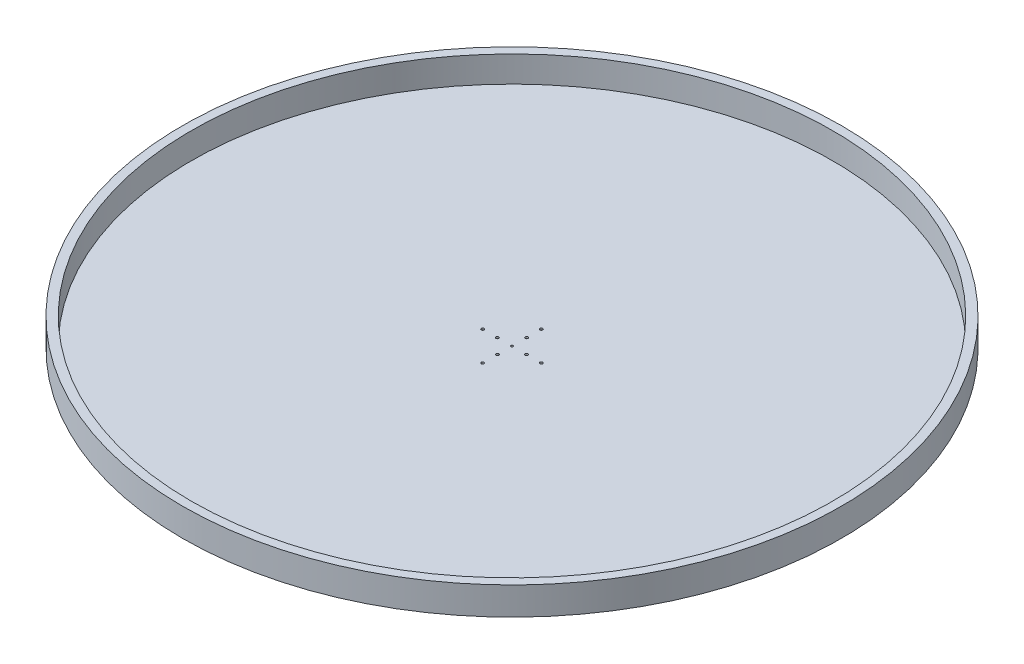
ISO-10303-21;
HEADER;
FILE_DESCRIPTION(('STEP AP214'),'2;1');
FILE_NAME('part.step','',(''),(''),'','','');
FILE_SCHEMA(('AUTOMOTIVE_DESIGN { 1 0 10303 214 1 1 1 1 }'));
ENDSEC;
DATA;
#1=APPLICATION_CONTEXT('core data for automotive mechanical design processes');
#2=APPLICATION_PROTOCOL_DEFINITION('international standard','automotive_design',2000,#1);
#3=PRODUCT_CONTEXT('',#1,'mechanical');
#4=PRODUCT('Part','Part','',(#3));
#5=PRODUCT_RELATED_PRODUCT_CATEGORY('part','',(#4));
#6=PRODUCT_DEFINITION_FORMATION('','',#4);
#7=PRODUCT_DEFINITION_CONTEXT('part definition',#1,'design');
#8=PRODUCT_DEFINITION('design','',#6,#7);
#9=PRODUCT_DEFINITION_SHAPE('','',#8);
#10=(LENGTH_UNIT() NAMED_UNIT(*) SI_UNIT(.MILLI.,.METRE.));
#11=(NAMED_UNIT(*) PLANE_ANGLE_UNIT() SI_UNIT($,.RADIAN.));
#12=(NAMED_UNIT(*) SI_UNIT($,.STERADIAN.) SOLID_ANGLE_UNIT());
#13=UNCERTAINTY_MEASURE_WITH_UNIT(LENGTH_MEASURE(1.E-05),#10,'distance_accuracy_value','');
#14=(GEOMETRIC_REPRESENTATION_CONTEXT(3) GLOBAL_UNCERTAINTY_ASSIGNED_CONTEXT((#13)) GLOBAL_UNIT_ASSIGNED_CONTEXT((#10,
#11,#12)) REPRESENTATION_CONTEXT('',''));
#15=CARTESIAN_POINT('',(0.,0.,0.));
#16=DIRECTION('',(0.,0.,1.));
#17=DIRECTION('',(1.,0.,0.));
#18=AXIS2_PLACEMENT_3D('',#15,#16,#17);
#19=CARTESIAN_POINT('',(0.,40.,0.));
#20=DIRECTION('',(0.,-1.,0.));
#21=DIRECTION('',(0.,0.,-1.));
#22=AXIS2_PLACEMENT_3D('',#19,#20,#21);
#23=CYLINDRICAL_SURFACE('',#22,472.5);
#24=CARTESIAN_POINT('',(0.,40.,0.));
#25=DIRECTION('',(0.,1.,0.));
#26=DIRECTION('',(0.,0.,1.));
#27=AXIS2_PLACEMENT_3D('',#24,#25,#26);
#28=CIRCLE('',#27,472.5);
#29=CARTESIAN_POINT('',(0.,40.,472.5));
#30=VERTEX_POINT('',#29);
#31=EDGE_CURVE('E10',#30,#30,#28,.T.);
#32=ORIENTED_EDGE('',*,*,#31,.F.);
#33=EDGE_LOOP('',(#32));
#34=FACE_BOUND('',#33,.T.);
#35=CARTESIAN_POINT('',(0.,0.,0.));
#36=DIRECTION('',(0.,1.,0.));
#37=DIRECTION('',(0.,0.,1.));
#38=AXIS2_PLACEMENT_3D('',#35,#36,#37);
#39=CIRCLE('',#38,472.5);
#40=CARTESIAN_POINT('',(0.,0.,472.5));
#41=VERTEX_POINT('',#40);
#42=EDGE_CURVE('E35',#41,#41,#39,.T.);
#43=ORIENTED_EDGE('',*,*,#42,.T.);
#44=EDGE_LOOP('',(#43));
#45=FACE_BOUND('',#44,.T.);
#46=ADVANCED_FACE('F32',(#34,#45),#23,.T.);
#47=CARTESIAN_POINT('',(0.,40.,0.));
#48=DIRECTION('',(0.,1.,0.));
#49=DIRECTION('',(0.,0.,1.));
#50=AXIS2_PLACEMENT_3D('',#47,#48,#49);
#51=PLANE('',#50);
#52=CARTESIAN_POINT('',(0.,40.,0.));
#53=DIRECTION('',(0.,1.,0.));
#54=DIRECTION('',(0.,0.,1.));
#55=AXIS2_PLACEMENT_3D('',#52,#53,#54);
#56=CIRCLE('',#55,460.);
#57=CARTESIAN_POINT('',(0.,40.,460.));
#58=VERTEX_POINT('',#57);
#59=EDGE_CURVE('E48',#58,#58,#56,.T.);
#60=ORIENTED_EDGE('',*,*,#59,.F.);
#61=EDGE_LOOP('',(#60));
#62=FACE_BOUND('',#61,.T.);
#63=ORIENTED_EDGE('',*,*,#31,.T.);
#64=EDGE_LOOP('',(#63));
#65=FACE_BOUND('',#64,.T.);
#66=ADVANCED_FACE('F165',(#62,#65),#51,.T.);
#67=CARTESIAN_POINT('',(0.,0.,0.));
#68=DIRECTION('',(0.,1.,0.));
#69=DIRECTION('',(0.,0.,1.));
#70=AXIS2_PLACEMENT_3D('',#67,#68,#69);
#71=PLANE('',#70);
#72=CARTESIAN_POINT('',(-20.9999999999994,0.,5.78204151224782E-13));
#73=DIRECTION('',(0.,1.,0.));
#74=DIRECTION('',(0.,0.,1.));
#75=AXIS2_PLACEMENT_3D('',#72,#73,#74);
#76=CIRCLE('',#75,2.02000000000096);
#77=CARTESIAN_POINT('',(-20.9999999999994,0.,2.02000000000154));
#78=VERTEX_POINT('',#77);
#79=EDGE_CURVE('E114',#78,#78,#76,.T.);
#80=ORIENTED_EDGE('',*,*,#79,.T.);
#81=EDGE_LOOP('',(#80));
#82=FACE_BOUND('',#81,.T.);
#83=CARTESIAN_POINT('',(1.16975646921169E-12,0.,21.));
#84=DIRECTION('',(0.,1.,0.));
#85=DIRECTION('',(0.,0.,1.));
#86=AXIS2_PLACEMENT_3D('',#83,#84,#85);
#87=CIRCLE('',#86,2.02000000000128);
#88=CARTESIAN_POINT('',(1.16975646921169E-12,0.,23.0200000000013));
#89=VERTEX_POINT('',#88);
#90=EDGE_CURVE('E106',#89,#89,#87,.T.);
#91=ORIENTED_EDGE('',*,*,#90,.T.);
#92=EDGE_LOOP('',(#91));
#93=FACE_BOUND('',#92,.T.);
#94=CARTESIAN_POINT('',(21.,0.,0.));
#95=DIRECTION('',(0.,1.,0.));
#96=DIRECTION('',(0.,0.,1.));
#97=AXIS2_PLACEMENT_3D('',#94,#95,#96);
#98=CIRCLE('',#97,2.02);
#99=CARTESIAN_POINT('',(21.,0.,2.02000000000009));
#100=VERTEX_POINT('',#99);
#101=EDGE_CURVE('E98',#100,#100,#98,.T.);
#102=ORIENTED_EDGE('',*,*,#101,.T.);
#103=EDGE_LOOP('',(#102));
#104=FACE_BOUND('',#103,.T.);
#105=CARTESIAN_POINT('',(-41.9999999999988,0.,1.19371179607697E-12));
#106=DIRECTION('',(0.,1.,0.));
#107=DIRECTION('',(0.,0.,1.));
#108=AXIS2_PLACEMENT_3D('',#105,#106,#107);
#109=CIRCLE('',#108,2.02000000000191);
#110=CARTESIAN_POINT('',(-41.9999999999988,0.,2.0200000000031));
#111=VERTEX_POINT('',#110);
#112=EDGE_CURVE('E90',#111,#111,#109,.T.);
#113=ORIENTED_EDGE('',*,*,#112,.T.);
#114=EDGE_LOOP('',(#113));
#115=FACE_BOUND('',#114,.T.);
#116=CARTESIAN_POINT('',(2.3771365590411E-12,0.,42.));
#117=DIRECTION('',(0.,1.,0.));
#118=DIRECTION('',(0.,0.,1.));
#119=AXIS2_PLACEMENT_3D('',#116,#117,#118);
#120=CIRCLE('',#119,2.02000000000255);
#121=CARTESIAN_POINT('',(2.3771365590411E-12,0.,44.0200000000026));
#122=VERTEX_POINT('',#121);
#123=EDGE_CURVE('E83',#122,#122,#120,.T.);
#124=ORIENTED_EDGE('',*,*,#123,.T.);
#125=EDGE_LOOP('',(#124));
#126=FACE_BOUND('',#125,.T.);
#127=CARTESIAN_POINT('',(42.0000000000012,0.,-1.18856827952055E-12));
#128=DIRECTION('',(0.,1.,0.));
#129=DIRECTION('',(0.,0.,1.));
#130=AXIS2_PLACEMENT_3D('',#127,#128,#129);
#131=CIRCLE('',#130,2.02000000000093);
#132=CARTESIAN_POINT('',(42.0000000000012,0.,2.01999999999974));
#133=VERTEX_POINT('',#132);
#134=EDGE_CURVE('E76',#133,#133,#131,.T.);
#135=ORIENTED_EDGE('',*,*,#134,.T.);
#136=EDGE_LOOP('',(#135));
#137=FACE_BOUND('',#136,.T.);
#138=CARTESIAN_POINT('',(0.,0.,-21.));
#139=DIRECTION('',(0.,1.,0.));
#140=DIRECTION('',(0.,0.,1.));
#141=AXIS2_PLACEMENT_3D('',#138,#139,#140);
#142=CIRCLE('',#141,2.02);
#143=CARTESIAN_POINT('',(0.,0.,-18.98));
#144=VERTEX_POINT('',#143);
#145=EDGE_CURVE('E68',#144,#144,#142,.T.);
#146=ORIENTED_EDGE('',*,*,#145,.T.);
#147=EDGE_LOOP('',(#146));
#148=FACE_BOUND('',#147,.T.);
#149=CARTESIAN_POINT('',(0.,0.,-42.));
#150=DIRECTION('',(0.,1.,0.));
#151=DIRECTION('',(0.,0.,1.));
#152=AXIS2_PLACEMENT_3D('',#149,#150,#151);
#153=CIRCLE('',#152,2.02);
#154=CARTESIAN_POINT('',(0.,0.,-39.98));
#155=VERTEX_POINT('',#154);
#156=EDGE_CURVE('E60',#155,#155,#153,.T.);
#157=ORIENTED_EDGE('',*,*,#156,.T.);
#158=EDGE_LOOP('',(#157));
#159=FACE_BOUND('',#158,.T.);
#160=CARTESIAN_POINT('',(0.,0.,0.));
#161=DIRECTION('',(0.,1.,0.));
#162=DIRECTION('',(0.,0.,1.));
#163=AXIS2_PLACEMENT_3D('',#160,#161,#162);
#164=CIRCLE('',#163,1.5);
#165=CARTESIAN_POINT('',(0.,0.,1.5));
#166=VERTEX_POINT('',#165);
#167=EDGE_CURVE('E52',#166,#166,#164,.T.);
#168=ORIENTED_EDGE('',*,*,#167,.T.);
#169=EDGE_LOOP('',(#168));
#170=FACE_BOUND('',#169,.T.);
#171=ORIENTED_EDGE('',*,*,#42,.F.);
#172=EDGE_LOOP('',(#171));
#173=FACE_BOUND('',#172,.T.);
#174=ADVANCED_FACE('F126',(#82,#93,#104,#115,#126,#137,#148,#159,#170,#173),#71,.F.);
#175=CARTESIAN_POINT('',(0.,2.54,0.));
#176=DIRECTION('',(0.,1.,0.));
#177=DIRECTION('',(0.,0.,1.));
#178=AXIS2_PLACEMENT_3D('',#175,#176,#177);
#179=CYLINDRICAL_SURFACE('',#178,460.);
#180=CARTESIAN_POINT('',(0.,2.54,0.));
#181=DIRECTION('',(0.,1.,0.));
#182=DIRECTION('',(0.,0.,1.));
#183=AXIS2_PLACEMENT_3D('',#180,#181,#182);
#184=CIRCLE('',#183,460.);
#185=CARTESIAN_POINT('',(0.,2.54,460.));
#186=VERTEX_POINT('',#185);
#187=EDGE_CURVE('E46',#186,#186,#184,.T.);
#188=ORIENTED_EDGE('',*,*,#187,.F.);
#189=EDGE_LOOP('',(#188));
#190=FACE_BOUND('',#189,.T.);
#191=ORIENTED_EDGE('',*,*,#59,.T.);
#192=EDGE_LOOP('',(#191));
#193=FACE_BOUND('',#192,.T.);
#194=ADVANCED_FACE('F140',(#190,#193),#179,.F.);
#195=CARTESIAN_POINT('',(0.,2.54,0.));
#196=DIRECTION('',(0.,1.,0.));
#197=DIRECTION('',(0.,0.,1.));
#198=AXIS2_PLACEMENT_3D('',#195,#196,#197);
#199=PLANE('',#198);
#200=CARTESIAN_POINT('',(-20.9999999999994,2.54,5.78204151224782E-13));
#201=DIRECTION('',(0.,1.,0.));
#202=DIRECTION('',(0.,0.,1.));
#203=AXIS2_PLACEMENT_3D('',#200,#201,#202);
#204=CIRCLE('',#203,2.02000000000096);
#205=CARTESIAN_POINT('',(-20.9999999999994,2.54,2.02000000000154));
#206=VERTEX_POINT('',#205);
#207=EDGE_CURVE('E118',#206,#206,#204,.T.);
#208=ORIENTED_EDGE('',*,*,#207,.F.);
#209=EDGE_LOOP('',(#208));
#210=FACE_BOUND('',#209,.T.);
#211=CARTESIAN_POINT('',(1.16975646921169E-12,2.54,21.));
#212=DIRECTION('',(0.,1.,0.));
#213=DIRECTION('',(0.,0.,1.));
#214=AXIS2_PLACEMENT_3D('',#211,#212,#213);
#215=CIRCLE('',#214,2.02000000000128);
#216=CARTESIAN_POINT('',(1.16975646921169E-12,2.54,23.0200000000013));
#217=VERTEX_POINT('',#216);
#218=EDGE_CURVE('E110',#217,#217,#215,.T.);
#219=ORIENTED_EDGE('',*,*,#218,.F.);
#220=EDGE_LOOP('',(#219));
#221=FACE_BOUND('',#220,.T.);
#222=CARTESIAN_POINT('',(21.,2.54,0.));
#223=DIRECTION('',(0.,1.,0.));
#224=DIRECTION('',(0.,0.,1.));
#225=AXIS2_PLACEMENT_3D('',#222,#223,#224);
#226=CIRCLE('',#225,2.02);
#227=CARTESIAN_POINT('',(21.,2.54,2.02000000000009));
#228=VERTEX_POINT('',#227);
#229=EDGE_CURVE('E102',#228,#228,#226,.T.);
#230=ORIENTED_EDGE('',*,*,#229,.F.);
#231=EDGE_LOOP('',(#230));
#232=FACE_BOUND('',#231,.T.);
#233=CARTESIAN_POINT('',(-41.9999999999988,2.54,1.19371179607697E-12));
#234=DIRECTION('',(0.,1.,0.));
#235=DIRECTION('',(0.,0.,1.));
#236=AXIS2_PLACEMENT_3D('',#233,#234,#235);
#237=CIRCLE('',#236,2.02000000000191);
#238=CARTESIAN_POINT('',(-41.9999999999988,2.54,2.0200000000031));
#239=VERTEX_POINT('',#238);
#240=EDGE_CURVE('E94',#239,#239,#237,.T.);
#241=ORIENTED_EDGE('',*,*,#240,.F.);
#242=EDGE_LOOP('',(#241));
#243=FACE_BOUND('',#242,.T.);
#244=CARTESIAN_POINT('',(2.3771365590411E-12,2.54,42.));
#245=DIRECTION('',(0.,1.,0.));
#246=DIRECTION('',(0.,0.,1.));
#247=AXIS2_PLACEMENT_3D('',#244,#245,#246);
#248=CIRCLE('',#247,2.02000000000255);
#249=CARTESIAN_POINT('',(2.3771365590411E-12,2.54,44.0200000000026));
#250=VERTEX_POINT('',#249);
#251=EDGE_CURVE('E87',#250,#250,#248,.T.);
#252=ORIENTED_EDGE('',*,*,#251,.F.);
#253=EDGE_LOOP('',(#252));
#254=FACE_BOUND('',#253,.T.);
#255=CARTESIAN_POINT('',(42.0000000000012,2.54,-1.18856827952055E-12));
#256=DIRECTION('',(0.,1.,0.));
#257=DIRECTION('',(0.,0.,1.));
#258=AXIS2_PLACEMENT_3D('',#255,#256,#257);
#259=CIRCLE('',#258,2.02000000000093);
#260=CARTESIAN_POINT('',(42.0000000000012,2.54,2.01999999999974));
#261=VERTEX_POINT('',#260);
#262=EDGE_CURVE('E79',#261,#261,#259,.T.);
#263=ORIENTED_EDGE('',*,*,#262,.F.);
#264=EDGE_LOOP('',(#263));
#265=FACE_BOUND('',#264,.T.);
#266=CARTESIAN_POINT('',(0.,2.54,-21.));
#267=DIRECTION('',(0.,1.,0.));
#268=DIRECTION('',(0.,0.,1.));
#269=AXIS2_PLACEMENT_3D('',#266,#267,#268);
#270=CIRCLE('',#269,2.02);
#271=CARTESIAN_POINT('',(0.,2.54,-18.98));
#272=VERTEX_POINT('',#271);
#273=EDGE_CURVE('E72',#272,#272,#270,.T.);
#274=ORIENTED_EDGE('',*,*,#273,.F.);
#275=EDGE_LOOP('',(#274));
#276=FACE_BOUND('',#275,.T.);
#277=CARTESIAN_POINT('',(0.,2.54,-42.));
#278=DIRECTION('',(0.,1.,0.));
#279=DIRECTION('',(0.,0.,1.));
#280=AXIS2_PLACEMENT_3D('',#277,#278,#279);
#281=CIRCLE('',#280,2.02);
#282=CARTESIAN_POINT('',(0.,2.54,-39.98));
#283=VERTEX_POINT('',#282);
#284=EDGE_CURVE('E64',#283,#283,#281,.T.);
#285=ORIENTED_EDGE('',*,*,#284,.F.);
#286=EDGE_LOOP('',(#285));
#287=FACE_BOUND('',#286,.T.);
#288=CARTESIAN_POINT('',(0.,2.54,0.));
#289=DIRECTION('',(0.,1.,0.));
#290=DIRECTION('',(0.,0.,1.));
#291=AXIS2_PLACEMENT_3D('',#288,#289,#290);
#292=CIRCLE('',#291,1.5);
#293=CARTESIAN_POINT('',(0.,2.54,1.5));
#294=VERTEX_POINT('',#293);
#295=EDGE_CURVE('E56',#294,#294,#292,.T.);
#296=ORIENTED_EDGE('',*,*,#295,.F.);
#297=EDGE_LOOP('',(#296));
#298=FACE_BOUND('',#297,.T.);
#299=ORIENTED_EDGE('',*,*,#187,.T.);
#300=EDGE_LOOP('',(#299));
#301=FACE_BOUND('',#300,.T.);
#302=ADVANCED_FACE('F136',(#210,#221,#232,#243,#254,#265,#276,#287,#298,#301),#199,.T.);
#303=CARTESIAN_POINT('',(0.,0.,0.));
#304=DIRECTION('',(0.,1.,0.));
#305=DIRECTION('',(0.,0.,1.));
#306=AXIS2_PLACEMENT_3D('',#303,#304,#305);
#307=CYLINDRICAL_SURFACE('',#306,1.5);
#308=ORIENTED_EDGE('',*,*,#167,.F.);
#309=EDGE_LOOP('',(#308));
#310=FACE_BOUND('',#309,.T.);
#311=ORIENTED_EDGE('',*,*,#295,.T.);
#312=EDGE_LOOP('',(#311));
#313=FACE_BOUND('',#312,.T.);
#314=ADVANCED_FACE('F139',(#310,#313),#307,.F.);
#315=CARTESIAN_POINT('',(0.,0.,-42.));
#316=DIRECTION('',(0.,1.,0.));
#317=DIRECTION('',(0.,0.,1.));
#318=AXIS2_PLACEMENT_3D('',#315,#316,#317);
#319=CYLINDRICAL_SURFACE('',#318,2.02);
#320=ORIENTED_EDGE('',*,*,#156,.F.);
#321=EDGE_LOOP('',(#320));
#322=FACE_BOUND('',#321,.T.);
#323=ORIENTED_EDGE('',*,*,#284,.T.);
#324=EDGE_LOOP('',(#323));
#325=FACE_BOUND('',#324,.T.);
#326=ADVANCED_FACE('F176',(#322,#325),#319,.F.);
#327=CARTESIAN_POINT('',(0.,0.,-21.));
#328=DIRECTION('',(0.,1.,0.));
#329=DIRECTION('',(0.,0.,1.));
#330=AXIS2_PLACEMENT_3D('',#327,#328,#329);
#331=CYLINDRICAL_SURFACE('',#330,2.02);
#332=ORIENTED_EDGE('',*,*,#145,.F.);
#333=EDGE_LOOP('',(#332));
#334=FACE_BOUND('',#333,.T.);
#335=ORIENTED_EDGE('',*,*,#273,.T.);
#336=EDGE_LOOP('',(#335));
#337=FACE_BOUND('',#336,.T.);
#338=ADVANCED_FACE('F180',(#334,#337),#331,.F.);
#339=CARTESIAN_POINT('',(42.0000000000012,0.,-1.18856827952055E-12));
#340=DIRECTION('',(0.,1.,0.));
#341=DIRECTION('',(0.,0.,1.));
#342=AXIS2_PLACEMENT_3D('',#339,#340,#341);
#343=CYLINDRICAL_SURFACE('',#342,2.02000000000093);
#344=ORIENTED_EDGE('',*,*,#134,.F.);
#345=EDGE_LOOP('',(#344));
#346=FACE_BOUND('',#345,.T.);
#347=ORIENTED_EDGE('',*,*,#262,.T.);
#348=EDGE_LOOP('',(#347));
#349=FACE_BOUND('',#348,.T.);
#350=ADVANCED_FACE('F184',(#346,#349),#343,.F.);
#351=CARTESIAN_POINT('',(2.3771365590411E-12,0.,42.));
#352=DIRECTION('',(0.,1.,0.));
#353=DIRECTION('',(0.,0.,1.));
#354=AXIS2_PLACEMENT_3D('',#351,#352,#353);
#355=CYLINDRICAL_SURFACE('',#354,2.02000000000255);
#356=ORIENTED_EDGE('',*,*,#123,.F.);
#357=EDGE_LOOP('',(#356));
#358=FACE_BOUND('',#357,.T.);
#359=ORIENTED_EDGE('',*,*,#251,.T.);
#360=EDGE_LOOP('',(#359));
#361=FACE_BOUND('',#360,.T.);
#362=ADVANCED_FACE('F188',(#358,#361),#355,.F.);
#363=CARTESIAN_POINT('',(-41.9999999999988,0.,1.19371179607697E-12));
#364=DIRECTION('',(0.,1.,0.));
#365=DIRECTION('',(0.,0.,1.));
#366=AXIS2_PLACEMENT_3D('',#363,#364,#365);
#367=CYLINDRICAL_SURFACE('',#366,2.02000000000191);
#368=ORIENTED_EDGE('',*,*,#112,.F.);
#369=EDGE_LOOP('',(#368));
#370=FACE_BOUND('',#369,.T.);
#371=ORIENTED_EDGE('',*,*,#240,.T.);
#372=EDGE_LOOP('',(#371));
#373=FACE_BOUND('',#372,.T.);
#374=ADVANCED_FACE('F192',(#370,#373),#367,.F.);
#375=CARTESIAN_POINT('',(21.,0.,0.));
#376=DIRECTION('',(0.,1.,0.));
#377=DIRECTION('',(0.,0.,1.));
#378=AXIS2_PLACEMENT_3D('',#375,#376,#377);
#379=CYLINDRICAL_SURFACE('',#378,2.02);
#380=ORIENTED_EDGE('',*,*,#101,.F.);
#381=EDGE_LOOP('',(#380));
#382=FACE_BOUND('',#381,.T.);
#383=ORIENTED_EDGE('',*,*,#229,.T.);
#384=EDGE_LOOP('',(#383));
#385=FACE_BOUND('',#384,.T.);
#386=ADVANCED_FACE('F196',(#382,#385),#379,.F.);
#387=CARTESIAN_POINT('',(1.16975646921169E-12,0.,21.));
#388=DIRECTION('',(0.,1.,0.));
#389=DIRECTION('',(0.,0.,1.));
#390=AXIS2_PLACEMENT_3D('',#387,#388,#389);
#391=CYLINDRICAL_SURFACE('',#390,2.02000000000128);
#392=ORIENTED_EDGE('',*,*,#90,.F.);
#393=EDGE_LOOP('',(#392));
#394=FACE_BOUND('',#393,.T.);
#395=ORIENTED_EDGE('',*,*,#218,.T.);
#396=EDGE_LOOP('',(#395));
#397=FACE_BOUND('',#396,.T.);
#398=ADVANCED_FACE('F132',(#394,#397),#391,.F.);
#399=CARTESIAN_POINT('',(-20.9999999999994,0.,5.78204151224782E-13));
#400=DIRECTION('',(0.,1.,0.));
#401=DIRECTION('',(0.,0.,1.));
#402=AXIS2_PLACEMENT_3D('',#399,#400,#401);
#403=CYLINDRICAL_SURFACE('',#402,2.02000000000096);
#404=ORIENTED_EDGE('',*,*,#79,.F.);
#405=EDGE_LOOP('',(#404));
#406=FACE_BOUND('',#405,.T.);
#407=ORIENTED_EDGE('',*,*,#207,.T.);
#408=EDGE_LOOP('',(#407));
#409=FACE_BOUND('',#408,.T.);
#410=ADVANCED_FACE('F129',(#406,#409),#403,.F.);
#411=CLOSED_SHELL('',(#46,#66,#174,#194,#302,#314,#326,#338,#350,#362,#374,#386,#398,#410));
#412=MANIFOLD_SOLID_BREP('B2',#411);
#413=ADVANCED_BREP_SHAPE_REPRESENTATION('',(#18,#412),#14);
#414=SHAPE_DEFINITION_REPRESENTATION(#9,#413);
ENDSEC;
END-ISO-10303-21;
